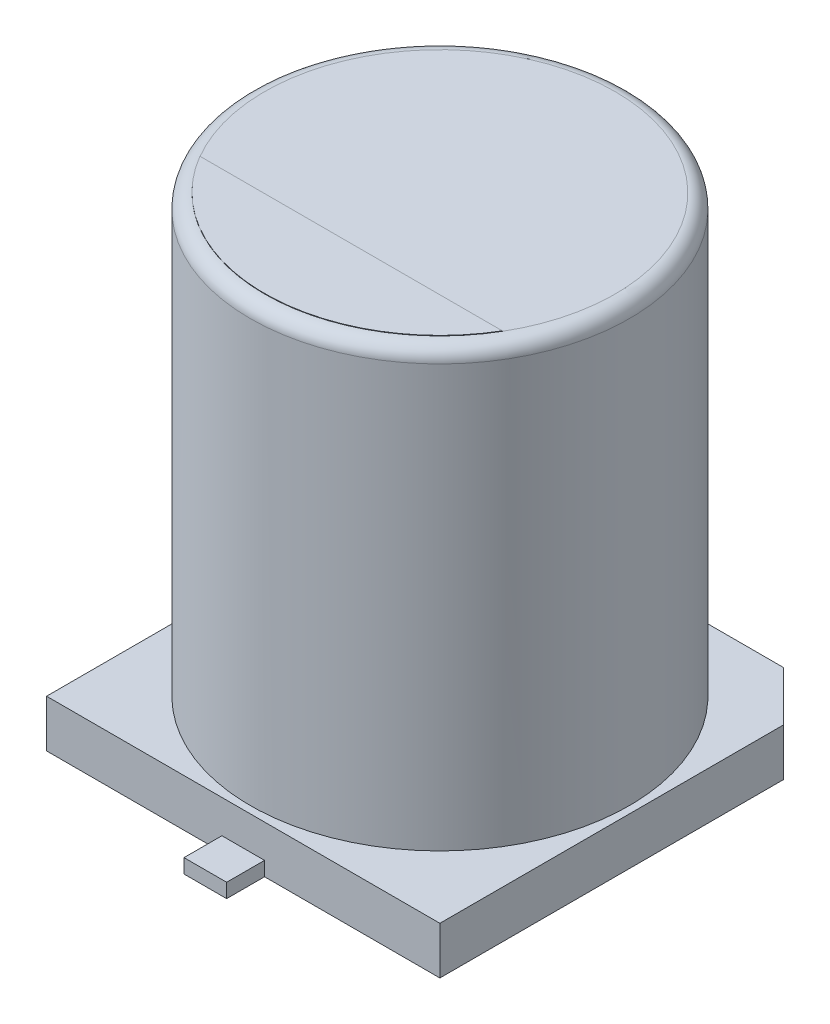
ISO-10303-21;
HEADER;
FILE_DESCRIPTION(('STEP AP214'),'2;1');
FILE_NAME('part.step','',(''),(''),'','','');
FILE_SCHEMA(('AUTOMOTIVE_DESIGN { 1 0 10303 214 1 1 1 1 }'));
ENDSEC;
DATA;
#1=APPLICATION_CONTEXT('core data for automotive mechanical design processes');
#2=APPLICATION_PROTOCOL_DEFINITION('international standard','automotive_design',2000,#1);
#3=PRODUCT_CONTEXT('',#1,'mechanical');
#4=PRODUCT('Part','Part','',(#3));
#5=PRODUCT_RELATED_PRODUCT_CATEGORY('part','',(#4));
#6=PRODUCT_DEFINITION_FORMATION('','',#4);
#7=PRODUCT_DEFINITION_CONTEXT('part definition',#1,'design');
#8=PRODUCT_DEFINITION('design','',#6,#7);
#9=PRODUCT_DEFINITION_SHAPE('','',#8);
#10=(LENGTH_UNIT() NAMED_UNIT(*) SI_UNIT(.MILLI.,.METRE.));
#11=(NAMED_UNIT(*) PLANE_ANGLE_UNIT() SI_UNIT($,.RADIAN.));
#12=(NAMED_UNIT(*) SI_UNIT($,.STERADIAN.) SOLID_ANGLE_UNIT());
#13=UNCERTAINTY_MEASURE_WITH_UNIT(LENGTH_MEASURE(1.E-05),#10,'distance_accuracy_value','');
#14=(GEOMETRIC_REPRESENTATION_CONTEXT(3) GLOBAL_UNCERTAINTY_ASSIGNED_CONTEXT((#13)) GLOBAL_UNIT_ASSIGNED_CONTEXT((#10,
#11,#12)) REPRESENTATION_CONTEXT('',''));
#15=CARTESIAN_POINT('',(0.,0.,0.));
#16=DIRECTION('',(0.,0.,1.));
#17=DIRECTION('',(1.,0.,0.));
#18=AXIS2_PLACEMENT_3D('',#15,#16,#17);
#19=CARTESIAN_POINT('',(0.,10.2,0.));
#20=DIRECTION('',(0.,1.,0.));
#21=DIRECTION('',(0.,0.,1.));
#22=AXIS2_PLACEMENT_3D('',#19,#20,#21);
#23=PLANE('',#22);
#24=CARTESIAN_POINT('',(0.,10.2,0.));
#25=DIRECTION('',(0.,1.,0.));
#26=DIRECTION('',(0.,0.,1.));
#27=AXIS2_PLACEMENT_3D('',#24,#25,#26);
#28=CIRCLE('',#27,3.7);
#29=CARTESIAN_POINT('',(3.1906821889042,10.2,1.87337854407739));
#30=VERTEX_POINT('',#29);
#31=CARTESIAN_POINT('',(-3.1906821889042,10.2,1.87337854407739));
#32=VERTEX_POINT('',#31);
#33=EDGE_CURVE('E221',#30,#32,#28,.T.);
#34=ORIENTED_EDGE('',*,*,#33,.T.);
#35=DIRECTION('',(-1.,0.,0.));
#36=VECTOR('',#35,1.);
#37=CARTESIAN_POINT('',(-3.1906821889042,10.2,1.87337854407739));
#38=LINE('',#37,#36);
#39=EDGE_CURVE('E159',#30,#32,#38,.T.);
#40=ORIENTED_EDGE('',*,*,#39,.F.);
#41=EDGE_LOOP('',(#34,#40));
#42=FACE_BOUND('',#41,.T.);
#43=ADVANCED_FACE('F33',(#42),#23,.T.);
#44=CARTESIAN_POINT('',(-3.1,1.,-4.15));
#45=DIRECTION('',(0.,0.,1.));
#46=DIRECTION('',(1.,0.,0.));
#47=AXIS2_PLACEMENT_3D('',#44,#45,#46);
#48=PLANE('',#47);
#49=DIRECTION('',(0.,-1.,0.));
#50=VECTOR('',#49,1.);
#51=CARTESIAN_POINT('',(0.449999999999999,1.,-4.15));
#52=LINE('',#51,#50);
#53=CARTESIAN_POINT('',(0.449999999999999,0.3,-4.15));
#54=VERTEX_POINT('',#53);
#55=CARTESIAN_POINT('',(0.449999999999998,0.,-4.15));
#56=VERTEX_POINT('',#55);
#57=EDGE_CURVE('E188',#54,#56,#52,.T.);
#58=ORIENTED_EDGE('',*,*,#57,.F.);
#59=DIRECTION('',(-1.,0.,0.));
#60=VECTOR('',#59,1.);
#61=CARTESIAN_POINT('',(-3.1,0.3,-4.15));
#62=LINE('',#61,#60);
#63=CARTESIAN_POINT('',(-0.450000000000001,0.3,-4.15));
#64=VERTEX_POINT('',#63);
#65=EDGE_CURVE('E11',#54,#64,#62,.T.);
#66=ORIENTED_EDGE('',*,*,#65,.T.);
#67=DIRECTION('',(0.,1.,0.));
#68=VECTOR('',#67,1.);
#69=CARTESIAN_POINT('',(-0.450000000000001,1.,-4.15));
#70=LINE('',#69,#68);
#71=CARTESIAN_POINT('',(-0.450000000000001,0.,-4.15));
#72=VERTEX_POINT('',#71);
#73=EDGE_CURVE('E186',#72,#64,#70,.T.);
#74=ORIENTED_EDGE('',*,*,#73,.F.);
#75=DIRECTION('',(-1.,0.,0.));
#76=VECTOR('',#75,1.);
#77=CARTESIAN_POINT('',(-3.1,0.,-4.15));
#78=LINE('',#77,#76);
#79=CARTESIAN_POINT('',(-3.1,0.,-4.15));
#80=VERTEX_POINT('',#79);
#81=EDGE_CURVE('E242',#72,#80,#78,.T.);
#82=ORIENTED_EDGE('',*,*,#81,.T.);
#83=DIRECTION('',(0.,-1.,0.));
#84=VECTOR('',#83,1.);
#85=CARTESIAN_POINT('',(-3.1,1.,-4.15));
#86=LINE('',#85,#84);
#87=CARTESIAN_POINT('',(-3.1,1.,-4.15));
#88=VERTEX_POINT('',#87);
#89=EDGE_CURVE('E259',#88,#80,#86,.T.);
#90=ORIENTED_EDGE('',*,*,#89,.F.);
#91=DIRECTION('',(-1.,0.,0.));
#92=VECTOR('',#91,1.);
#93=CARTESIAN_POINT('',(-3.1,1.,-4.15));
#94=LINE('',#93,#92);
#95=CARTESIAN_POINT('',(3.1,1.,-4.15));
#96=VERTEX_POINT('',#95);
#97=EDGE_CURVE('E229',#96,#88,#94,.T.);
#98=ORIENTED_EDGE('',*,*,#97,.F.);
#99=DIRECTION('',(0.,-1.,0.));
#100=VECTOR('',#99,1.);
#101=CARTESIAN_POINT('',(3.1,1.,-4.15));
#102=LINE('',#101,#100);
#103=CARTESIAN_POINT('',(3.1,0.,-4.15));
#104=VERTEX_POINT('',#103);
#105=EDGE_CURVE('E262',#96,#104,#102,.T.);
#106=ORIENTED_EDGE('',*,*,#105,.T.);
#107=EDGE_CURVE('E243',#104,#56,#78,.T.);
#108=ORIENTED_EDGE('',*,*,#107,.T.);
#109=EDGE_LOOP('',(#58,#66,#74,#82,#90,#98,#106,#108));
#110=FACE_BOUND('',#109,.T.);
#111=ADVANCED_FACE('F319',(#110),#48,.F.);
#112=CARTESIAN_POINT('',(4.15,1.,4.15));
#113=DIRECTION('',(0.,0.,-1.));
#114=DIRECTION('',(-1.,0.,0.));
#115=AXIS2_PLACEMENT_3D('',#112,#113,#114);
#116=PLANE('',#115);
#117=DIRECTION('',(0.,-1.,0.));
#118=VECTOR('',#117,1.);
#119=CARTESIAN_POINT('',(-0.450000000000001,1.,4.15));
#120=LINE('',#119,#118);
#121=CARTESIAN_POINT('',(-0.450000000000002,0.3,4.15));
#122=VERTEX_POINT('',#121);
#123=CARTESIAN_POINT('',(-0.449999999999999,0.,4.15));
#124=VERTEX_POINT('',#123);
#125=EDGE_CURVE('E214',#122,#124,#120,.T.);
#126=ORIENTED_EDGE('',*,*,#125,.F.);
#127=DIRECTION('',(-1.,0.,0.));
#128=VECTOR('',#127,1.);
#129=CARTESIAN_POINT('',(4.15,0.3,4.15));
#130=LINE('',#129,#128);
#131=CARTESIAN_POINT('',(0.449999999999999,0.3,4.15));
#132=VERTEX_POINT('',#131);
#133=EDGE_CURVE('E41',#132,#122,#130,.T.);
#134=ORIENTED_EDGE('',*,*,#133,.F.);
#135=DIRECTION('',(0.,1.,0.));
#136=VECTOR('',#135,1.);
#137=CARTESIAN_POINT('',(0.449999999999999,1.,4.15));
#138=LINE('',#137,#136);
#139=CARTESIAN_POINT('',(0.449999999999999,0.,4.15));
#140=VERTEX_POINT('',#139);
#141=EDGE_CURVE('E211',#140,#132,#138,.T.);
#142=ORIENTED_EDGE('',*,*,#141,.F.);
#143=DIRECTION('',(1.,0.,0.));
#144=VECTOR('',#143,1.);
#145=CARTESIAN_POINT('',(4.15,0.,4.15));
#146=LINE('',#145,#144);
#147=CARTESIAN_POINT('',(4.15,0.,4.15));
#148=VERTEX_POINT('',#147);
#149=EDGE_CURVE('E249',#140,#148,#146,.T.);
#150=ORIENTED_EDGE('',*,*,#149,.T.);
#151=DIRECTION('',(0.,-1.,0.));
#152=VECTOR('',#151,1.);
#153=CARTESIAN_POINT('',(4.15,1.,4.15));
#154=LINE('',#153,#152);
#155=CARTESIAN_POINT('',(4.15,1.,4.15));
#156=VERTEX_POINT('',#155);
#157=EDGE_CURVE('E237',#156,#148,#154,.T.);
#158=ORIENTED_EDGE('',*,*,#157,.F.);
#159=DIRECTION('',(1.,0.,0.));
#160=VECTOR('',#159,1.);
#161=CARTESIAN_POINT('',(4.15,1.,4.15));
#162=LINE('',#161,#160);
#163=CARTESIAN_POINT('',(-4.15,1.,4.15));
#164=VERTEX_POINT('',#163);
#165=EDGE_CURVE('E235',#164,#156,#162,.T.);
#166=ORIENTED_EDGE('',*,*,#165,.F.);
#167=DIRECTION('',(0.,-1.,0.));
#168=VECTOR('',#167,1.);
#169=CARTESIAN_POINT('',(-4.15,1.,4.15));
#170=LINE('',#169,#168);
#171=CARTESIAN_POINT('',(-4.15,0.,4.15));
#172=VERTEX_POINT('',#171);
#173=EDGE_CURVE('E253',#164,#172,#170,.T.);
#174=ORIENTED_EDGE('',*,*,#173,.T.);
#175=EDGE_CURVE('E227',#172,#124,#146,.T.);
#176=ORIENTED_EDGE('',*,*,#175,.T.);
#177=EDGE_LOOP('',(#126,#134,#142,#150,#158,#166,#174,#176));
#178=FACE_BOUND('',#177,.T.);
#179=ADVANCED_FACE('F289',(#178),#116,.F.);
#180=CARTESIAN_POINT('',(4.15,1.,-3.1));
#181=DIRECTION('',(-1.,0.,0.));
#182=DIRECTION('',(0.,0.,1.));
#183=AXIS2_PLACEMENT_3D('',#180,#181,#182);
#184=PLANE('',#183);
#185=DIRECTION('',(0.,0.,-1.));
#186=VECTOR('',#185,1.);
#187=CARTESIAN_POINT('',(4.15,0.,-3.1));
#188=LINE('',#187,#186);
#189=CARTESIAN_POINT('',(4.15,0.,-3.1));
#190=VERTEX_POINT('',#189);
#191=EDGE_CURVE('E217',#148,#190,#188,.T.);
#192=ORIENTED_EDGE('',*,*,#191,.T.);
#193=DIRECTION('',(0.,-1.,0.));
#194=VECTOR('',#193,1.);
#195=CARTESIAN_POINT('',(4.15,1.,-3.1));
#196=LINE('',#195,#194);
#197=CARTESIAN_POINT('',(4.15,1.,-3.1));
#198=VERTEX_POINT('',#197);
#199=EDGE_CURVE('E222',#198,#190,#196,.T.);
#200=ORIENTED_EDGE('',*,*,#199,.F.);
#201=DIRECTION('',(0.,0.,-1.));
#202=VECTOR('',#201,1.);
#203=CARTESIAN_POINT('',(4.15,1.,-3.1));
#204=LINE('',#203,#202);
#205=EDGE_CURVE('E223',#156,#198,#204,.T.);
#206=ORIENTED_EDGE('',*,*,#205,.F.);
#207=ORIENTED_EDGE('',*,*,#157,.T.);
#208=EDGE_LOOP('',(#192,#200,#206,#207));
#209=FACE_BOUND('',#208,.T.);
#210=ADVANCED_FACE('F296',(#209),#184,.F.);
#211=CARTESIAN_POINT('',(3.1,1.,-4.15));
#212=DIRECTION('',(-0.707106781186548,0.,0.707106781186547));
#213=DIRECTION('',(0.707106781186547,0.,0.707106781186548));
#214=AXIS2_PLACEMENT_3D('',#211,#212,#213);
#215=PLANE('',#214);
#216=DIRECTION('',(-0.707106781186547,0.,-0.707106781186548));
#217=VECTOR('',#216,1.);
#218=CARTESIAN_POINT('',(3.1,0.,-4.15));
#219=LINE('',#218,#217);
#220=EDGE_CURVE('E240',#190,#104,#219,.T.);
#221=ORIENTED_EDGE('',*,*,#220,.T.);
#222=ORIENTED_EDGE('',*,*,#105,.F.);
#223=DIRECTION('',(-0.707106781186547,0.,-0.707106781186548));
#224=VECTOR('',#223,1.);
#225=CARTESIAN_POINT('',(3.1,1.,-4.15));
#226=LINE('',#225,#224);
#227=EDGE_CURVE('E226',#198,#96,#226,.T.);
#228=ORIENTED_EDGE('',*,*,#227,.F.);
#229=ORIENTED_EDGE('',*,*,#199,.T.);
#230=EDGE_LOOP('',(#221,#222,#228,#229));
#231=FACE_BOUND('',#230,.T.);
#232=ADVANCED_FACE('F303',(#231),#215,.F.);
#233=CARTESIAN_POINT('',(-4.15,1.,-3.1));
#234=DIRECTION('',(0.707106781186548,0.,0.707106781186547));
#235=DIRECTION('',(0.707106781186547,0.,-0.707106781186548));
#236=AXIS2_PLACEMENT_3D('',#233,#234,#235);
#237=PLANE('',#236);
#238=DIRECTION('',(-0.707106781186547,0.,0.707106781186548));
#239=VECTOR('',#238,1.);
#240=CARTESIAN_POINT('',(-4.15,0.,-3.1));
#241=LINE('',#240,#239);
#242=CARTESIAN_POINT('',(-4.15,0.,-3.1));
#243=VERTEX_POINT('',#242);
#244=EDGE_CURVE('E245',#80,#243,#241,.T.);
#245=ORIENTED_EDGE('',*,*,#244,.T.);
#246=DIRECTION('',(0.,-1.,0.));
#247=VECTOR('',#246,1.);
#248=CARTESIAN_POINT('',(-4.15,1.,-3.1));
#249=LINE('',#248,#247);
#250=CARTESIAN_POINT('',(-4.15,1.,-3.1));
#251=VERTEX_POINT('',#250);
#252=EDGE_CURVE('E256',#251,#243,#249,.T.);
#253=ORIENTED_EDGE('',*,*,#252,.F.);
#254=DIRECTION('',(-0.707106781186547,0.,0.707106781186548));
#255=VECTOR('',#254,1.);
#256=CARTESIAN_POINT('',(-4.15,1.,-3.1));
#257=LINE('',#256,#255);
#258=EDGE_CURVE('E231',#88,#251,#257,.T.);
#259=ORIENTED_EDGE('',*,*,#258,.F.);
#260=ORIENTED_EDGE('',*,*,#89,.T.);
#261=EDGE_LOOP('',(#245,#253,#259,#260));
#262=FACE_BOUND('',#261,.T.);
#263=ADVANCED_FACE('F317',(#262),#237,.F.);
#264=CARTESIAN_POINT('',(-4.15,1.,4.15));
#265=DIRECTION('',(1.,0.,0.));
#266=DIRECTION('',(0.,0.,-1.));
#267=AXIS2_PLACEMENT_3D('',#264,#265,#266);
#268=PLANE('',#267);
#269=DIRECTION('',(0.,0.,1.));
#270=VECTOR('',#269,1.);
#271=CARTESIAN_POINT('',(-4.15,0.,4.15));
#272=LINE('',#271,#270);
#273=EDGE_CURVE('E247',#243,#172,#272,.T.);
#274=ORIENTED_EDGE('',*,*,#273,.T.);
#275=ORIENTED_EDGE('',*,*,#173,.F.);
#276=DIRECTION('',(0.,0.,1.));
#277=VECTOR('',#276,1.);
#278=CARTESIAN_POINT('',(-4.15,1.,4.15));
#279=LINE('',#278,#277);
#280=EDGE_CURVE('E233',#251,#164,#279,.T.);
#281=ORIENTED_EDGE('',*,*,#280,.F.);
#282=ORIENTED_EDGE('',*,*,#252,.T.);
#283=EDGE_LOOP('',(#274,#275,#281,#282));
#284=FACE_BOUND('',#283,.T.);
#285=ADVANCED_FACE('F313',(#284),#268,.F.);
#286=CARTESIAN_POINT('',(0.,1.,0.));
#287=DIRECTION('',(0.,-1.,0.));
#288=DIRECTION('',(0.,0.,-1.));
#289=AXIS2_PLACEMENT_3D('',#286,#287,#288);
#290=PLANE('',#289);
#291=CARTESIAN_POINT('',(0.,0.999999999999999,0.));
#292=DIRECTION('',(0.,-1.,0.));
#293=DIRECTION('',(0.,0.,-1.));
#294=AXIS2_PLACEMENT_3D('',#291,#292,#293);
#295=CIRCLE('',#294,4.);
#296=CARTESIAN_POINT('',(0.,0.999999999999999,-4.));
#297=VERTEX_POINT('',#296);
#298=EDGE_CURVE('E218',#297,#297,#295,.F.);
#299=ORIENTED_EDGE('',*,*,#298,.F.);
#300=EDGE_LOOP('',(#299));
#301=FACE_BOUND('',#300,.T.);
#302=ORIENTED_EDGE('',*,*,#205,.T.);
#303=ORIENTED_EDGE('',*,*,#227,.T.);
#304=ORIENTED_EDGE('',*,*,#97,.T.);
#305=ORIENTED_EDGE('',*,*,#258,.T.);
#306=ORIENTED_EDGE('',*,*,#280,.T.);
#307=ORIENTED_EDGE('',*,*,#165,.T.);
#308=EDGE_LOOP('',(#302,#303,#304,#305,#306,#307));
#309=FACE_BOUND('',#308,.T.);
#310=ADVANCED_FACE('F306',(#301,#309),#290,.F.);
#311=CARTESIAN_POINT('',(0.,0.,0.));
#312=DIRECTION('',(0.,-1.,0.));
#313=DIRECTION('',(0.,0.,-1.));
#314=AXIS2_PLACEMENT_3D('',#311,#312,#313);
#315=PLANE('',#314);
#316=ORIENTED_EDGE('',*,*,#81,.F.);
#317=DIRECTION('',(0.,0.,1.));
#318=VECTOR('',#317,1.);
#319=CARTESIAN_POINT('',(-0.45,0.,-1.55));
#320=LINE('',#319,#318);
#321=CARTESIAN_POINT('',(-0.450000000000001,0.,-4.95));
#322=VERTEX_POINT('',#321);
#323=EDGE_CURVE('E172',#322,#72,#320,.T.);
#324=ORIENTED_EDGE('',*,*,#323,.F.);
#325=DIRECTION('',(-1.,0.,0.));
#326=VECTOR('',#325,1.);
#327=CARTESIAN_POINT('',(0.449999999999999,0.,-4.95));
#328=LINE('',#327,#326);
#329=CARTESIAN_POINT('',(0.449999999999999,0.,-4.95));
#330=VERTEX_POINT('',#329);
#331=EDGE_CURVE('E164',#330,#322,#328,.T.);
#332=ORIENTED_EDGE('',*,*,#331,.F.);
#333=DIRECTION('',(0.,0.,-1.));
#334=VECTOR('',#333,1.);
#335=CARTESIAN_POINT('',(0.449999999999999,0.,-1.55));
#336=LINE('',#335,#334);
#337=EDGE_CURVE('E162',#56,#330,#336,.T.);
#338=ORIENTED_EDGE('',*,*,#337,.F.);
#339=ORIENTED_EDGE('',*,*,#107,.F.);
#340=ORIENTED_EDGE('',*,*,#220,.F.);
#341=ORIENTED_EDGE('',*,*,#191,.F.);
#342=ORIENTED_EDGE('',*,*,#149,.F.);
#343=DIRECTION('',(0.,0.,-1.));
#344=VECTOR('',#343,1.);
#345=CARTESIAN_POINT('',(0.449999999999999,0.,1.55));
#346=LINE('',#345,#344);
#347=CARTESIAN_POINT('',(0.449999999999999,0.,4.95));
#348=VERTEX_POINT('',#347);
#349=EDGE_CURVE('E195',#348,#140,#346,.T.);
#350=ORIENTED_EDGE('',*,*,#349,.F.);
#351=DIRECTION('',(1.,0.,0.));
#352=VECTOR('',#351,1.);
#353=CARTESIAN_POINT('',(0.449999999999999,0.,4.95));
#354=LINE('',#353,#352);
#355=CARTESIAN_POINT('',(-0.450000000000001,0.,4.95));
#356=VERTEX_POINT('',#355);
#357=EDGE_CURVE('E202',#356,#348,#354,.T.);
#358=ORIENTED_EDGE('',*,*,#357,.F.);
#359=DIRECTION('',(0.,0.,1.));
#360=VECTOR('',#359,1.);
#361=CARTESIAN_POINT('',(-0.45,0.,1.55));
#362=LINE('',#361,#360);
#363=EDGE_CURVE('E191',#124,#356,#362,.T.);
#364=ORIENTED_EDGE('',*,*,#363,.F.);
#365=ORIENTED_EDGE('',*,*,#175,.F.);
#366=ORIENTED_EDGE('',*,*,#273,.F.);
#367=ORIENTED_EDGE('',*,*,#244,.F.);
#368=EDGE_LOOP('',(#316,#324,#332,#338,#339,#340,#341,#342,#350,#358,#364,#365,#366,#367));
#369=FACE_BOUND('',#368,.T.);
#370=ADVANCED_FACE('F298',(#369),#315,.T.);
#371=CARTESIAN_POINT('',(0.,10.2,0.));
#372=DIRECTION('',(0.,-1.,0.));
#373=DIRECTION('',(0.,0.,-1.));
#374=AXIS2_PLACEMENT_3D('',#371,#372,#373);
#375=CYLINDRICAL_SURFACE('',#374,4.);
#376=CARTESIAN_POINT('',(0.,9.9,0.));
#377=DIRECTION('',(0.,1.,0.));
#378=DIRECTION('',(0.,0.,1.));
#379=AXIS2_PLACEMENT_3D('',#376,#377,#378);
#380=CIRCLE('',#379,4.);
#381=CARTESIAN_POINT('',(0.,9.9,4.));
#382=VERTEX_POINT('',#381);
#383=EDGE_CURVE('E268',#382,#382,#380,.F.);
#384=ORIENTED_EDGE('',*,*,#383,.T.);
#385=EDGE_LOOP('',(#384));
#386=FACE_BOUND('',#385,.T.);
#387=ORIENTED_EDGE('',*,*,#298,.T.);
#388=EDGE_LOOP('',(#387));
#389=FACE_BOUND('',#388,.T.);
#390=ADVANCED_FACE('F354',(#386,#389),#375,.T.);
#391=CARTESIAN_POINT('',(0.,9.9,0.));
#392=DIRECTION('',(0.,1.,0.));
#393=DIRECTION('',(0.,0.,1.));
#394=AXIS2_PLACEMENT_3D('',#391,#392,#393);
#395=TOROIDAL_SURFACE('',#394,3.7,0.3);
#396=ORIENTED_EDGE('',*,*,#383,.F.);
#397=EDGE_LOOP('',(#396));
#398=FACE_BOUND('',#397,.T.);
#399=ORIENTED_EDGE('',*,*,#33,.F.);
#400=CARTESIAN_POINT('',(0.,10.2,0.));
#401=DIRECTION('',(0.,1.,0.));
#402=DIRECTION('',(0.,0.,1.));
#403=AXIS2_PLACEMENT_3D('',#400,#401,#402);
#404=CIRCLE('',#403,3.7);
#405=EDGE_CURVE('E47',#32,#30,#404,.T.);
#406=ORIENTED_EDGE('',*,*,#405,.F.);
#407=EDGE_LOOP('',(#399,#406));
#408=FACE_BOUND('',#407,.T.);
#409=ADVANCED_FACE('F35',(#398,#408),#395,.T.);
#410=CARTESIAN_POINT('',(0.,0.3,0.));
#411=DIRECTION('',(0.,-1.,0.));
#412=DIRECTION('',(0.,0.,-1.));
#413=AXIS2_PLACEMENT_3D('',#410,#411,#412);
#414=PLANE('',#413);
#415=DIRECTION('',(0.,0.,-1.));
#416=VECTOR('',#415,1.);
#417=CARTESIAN_POINT('',(0.449999999999999,0.3,1.55));
#418=LINE('',#417,#416);
#419=CARTESIAN_POINT('',(0.449999999999999,0.3,4.95));
#420=VERTEX_POINT('',#419);
#421=EDGE_CURVE('E197',#420,#132,#418,.T.);
#422=ORIENTED_EDGE('',*,*,#421,.T.);
#423=ORIENTED_EDGE('',*,*,#133,.T.);
#424=DIRECTION('',(0.,0.,1.));
#425=VECTOR('',#424,1.);
#426=CARTESIAN_POINT('',(-0.45,0.3,1.55));
#427=LINE('',#426,#425);
#428=CARTESIAN_POINT('',(-0.450000000000001,0.3,4.95));
#429=VERTEX_POINT('',#428);
#430=EDGE_CURVE('E192',#122,#429,#427,.T.);
#431=ORIENTED_EDGE('',*,*,#430,.T.);
#432=DIRECTION('',(1.,0.,0.));
#433=VECTOR('',#432,1.);
#434=CARTESIAN_POINT('',(0.449999999999999,0.3,4.95));
#435=LINE('',#434,#433);
#436=EDGE_CURVE('E194',#429,#420,#435,.T.);
#437=ORIENTED_EDGE('',*,*,#436,.T.);
#438=EDGE_LOOP('',(#422,#423,#431,#437));
#439=FACE_BOUND('',#438,.T.);
#440=ADVANCED_FACE('F273',(#439),#414,.F.);
#441=CARTESIAN_POINT('',(-0.45,0.3,1.55));
#442=DIRECTION('',(1.,0.,0.));
#443=DIRECTION('',(0.,0.,-1.));
#444=AXIS2_PLACEMENT_3D('',#441,#442,#443);
#445=PLANE('',#444);
#446=ORIENTED_EDGE('',*,*,#430,.F.);
#447=ORIENTED_EDGE('',*,*,#125,.T.);
#448=ORIENTED_EDGE('',*,*,#363,.T.);
#449=DIRECTION('',(0.,-1.,0.));
#450=VECTOR('',#449,1.);
#451=CARTESIAN_POINT('',(-0.450000000000001,0.3,4.95));
#452=LINE('',#451,#450);
#453=EDGE_CURVE('E208',#429,#356,#452,.T.);
#454=ORIENTED_EDGE('',*,*,#453,.F.);
#455=EDGE_LOOP('',(#446,#447,#448,#454));
#456=FACE_BOUND('',#455,.T.);
#457=ADVANCED_FACE('F280',(#456),#445,.F.);
#458=CARTESIAN_POINT('',(0.449999999999999,0.3,1.55));
#459=DIRECTION('',(-1.,0.,0.));
#460=DIRECTION('',(0.,0.,1.));
#461=AXIS2_PLACEMENT_3D('',#458,#459,#460);
#462=PLANE('',#461);
#463=ORIENTED_EDGE('',*,*,#349,.T.);
#464=ORIENTED_EDGE('',*,*,#141,.T.);
#465=ORIENTED_EDGE('',*,*,#421,.F.);
#466=DIRECTION('',(0.,-1.,0.));
#467=VECTOR('',#466,1.);
#468=CARTESIAN_POINT('',(0.449999999999999,0.3,4.95));
#469=LINE('',#468,#467);
#470=EDGE_CURVE('E200',#420,#348,#469,.T.);
#471=ORIENTED_EDGE('',*,*,#470,.T.);
#472=EDGE_LOOP('',(#463,#464,#465,#471));
#473=FACE_BOUND('',#472,.T.);
#474=ADVANCED_FACE('F288',(#473),#462,.F.);
#475=CARTESIAN_POINT('',(0.449999999999999,0.3,4.95));
#476=DIRECTION('',(0.,0.,-1.));
#477=DIRECTION('',(-1.,0.,0.));
#478=AXIS2_PLACEMENT_3D('',#475,#476,#477);
#479=PLANE('',#478);
#480=ORIENTED_EDGE('',*,*,#357,.T.);
#481=ORIENTED_EDGE('',*,*,#470,.F.);
#482=ORIENTED_EDGE('',*,*,#436,.F.);
#483=ORIENTED_EDGE('',*,*,#453,.T.);
#484=EDGE_LOOP('',(#480,#481,#482,#483));
#485=FACE_BOUND('',#484,.T.);
#486=ADVANCED_FACE('F284',(#485),#479,.F.);
#487=CARTESIAN_POINT('',(0.,0.3,0.));
#488=DIRECTION('',(0.,1.,0.));
#489=DIRECTION('',(0.,0.,1.));
#490=AXIS2_PLACEMENT_3D('',#487,#488,#489);
#491=PLANE('',#490);
#492=ORIENTED_EDGE('',*,*,#65,.F.);
#493=DIRECTION('',(0.,0.,-1.));
#494=VECTOR('',#493,1.);
#495=CARTESIAN_POINT('',(0.449999999999999,0.3,-1.55));
#496=LINE('',#495,#494);
#497=CARTESIAN_POINT('',(0.449999999999999,0.3,-4.95));
#498=VERTEX_POINT('',#497);
#499=EDGE_CURVE('E169',#54,#498,#496,.T.);
#500=ORIENTED_EDGE('',*,*,#499,.T.);
#501=DIRECTION('',(-1.,0.,0.));
#502=VECTOR('',#501,1.);
#503=CARTESIAN_POINT('',(0.449999999999999,0.3,-4.95));
#504=LINE('',#503,#502);
#505=CARTESIAN_POINT('',(-0.450000000000001,0.3,-4.95));
#506=VERTEX_POINT('',#505);
#507=EDGE_CURVE('E171',#498,#506,#504,.T.);
#508=ORIENTED_EDGE('',*,*,#507,.T.);
#509=DIRECTION('',(0.,0.,1.));
#510=VECTOR('',#509,1.);
#511=CARTESIAN_POINT('',(-0.45,0.3,-1.55));
#512=LINE('',#511,#510);
#513=EDGE_CURVE('E174',#506,#64,#512,.T.);
#514=ORIENTED_EDGE('',*,*,#513,.T.);
#515=EDGE_LOOP('',(#492,#500,#508,#514));
#516=FACE_BOUND('',#515,.T.);
#517=ADVANCED_FACE('F334',(#516),#491,.T.);
#518=CARTESIAN_POINT('',(0.449999999999999,0.3,-1.55));
#519=DIRECTION('',(-1.,0.,0.));
#520=DIRECTION('',(0.,0.,1.));
#521=AXIS2_PLACEMENT_3D('',#518,#519,#520);
#522=PLANE('',#521);
#523=ORIENTED_EDGE('',*,*,#499,.F.);
#524=ORIENTED_EDGE('',*,*,#57,.T.);
#525=ORIENTED_EDGE('',*,*,#337,.T.);
#526=DIRECTION('',(0.,-1.,0.));
#527=VECTOR('',#526,1.);
#528=CARTESIAN_POINT('',(0.449999999999999,0.3,-4.95));
#529=LINE('',#528,#527);
#530=EDGE_CURVE('E183',#498,#330,#529,.T.);
#531=ORIENTED_EDGE('',*,*,#530,.F.);
#532=EDGE_LOOP('',(#523,#524,#525,#531));
#533=FACE_BOUND('',#532,.T.);
#534=ADVANCED_FACE('F332',(#533),#522,.F.);
#535=CARTESIAN_POINT('',(-0.45,0.3,-1.55));
#536=DIRECTION('',(1.,0.,0.));
#537=DIRECTION('',(0.,0.,-1.));
#538=AXIS2_PLACEMENT_3D('',#535,#536,#537);
#539=PLANE('',#538);
#540=ORIENTED_EDGE('',*,*,#323,.T.);
#541=ORIENTED_EDGE('',*,*,#73,.T.);
#542=ORIENTED_EDGE('',*,*,#513,.F.);
#543=DIRECTION('',(0.,-1.,0.));
#544=VECTOR('',#543,1.);
#545=CARTESIAN_POINT('',(-0.450000000000001,0.3,-4.95));
#546=LINE('',#545,#544);
#547=EDGE_CURVE('E176',#506,#322,#546,.T.);
#548=ORIENTED_EDGE('',*,*,#547,.T.);
#549=EDGE_LOOP('',(#540,#541,#542,#548));
#550=FACE_BOUND('',#549,.T.);
#551=ADVANCED_FACE('F323',(#550),#539,.F.);
#552=CARTESIAN_POINT('',(0.449999999999999,0.3,-4.95));
#553=DIRECTION('',(0.,0.,1.));
#554=DIRECTION('',(1.,0.,0.));
#555=AXIS2_PLACEMENT_3D('',#552,#553,#554);
#556=PLANE('',#555);
#557=ORIENTED_EDGE('',*,*,#331,.T.);
#558=ORIENTED_EDGE('',*,*,#547,.F.);
#559=ORIENTED_EDGE('',*,*,#507,.F.);
#560=ORIENTED_EDGE('',*,*,#530,.T.);
#561=EDGE_LOOP('',(#557,#558,#559,#560));
#562=FACE_BOUND('',#561,.T.);
#563=ADVANCED_FACE('F328',(#562),#556,.F.);
#564=CARTESIAN_POINT('',(0.,10.21,0.));
#565=DIRECTION('',(0.,-1.,0.));
#566=DIRECTION('',(0.,0.,-1.));
#567=AXIS2_PLACEMENT_3D('',#564,#565,#566);
#568=CYLINDRICAL_SURFACE('',#567,3.7);
#569=ORIENTED_EDGE('',*,*,#405,.T.);
#570=DIRECTION('',(0.,-1.,0.));
#571=VECTOR('',#570,1.);
#572=CARTESIAN_POINT('',(3.1906821889042,10.21,1.87337854407739));
#573=LINE('',#572,#571);
#574=CARTESIAN_POINT('',(3.1906821889042,10.21,1.87337854407739));
#575=VERTEX_POINT('',#574);
#576=EDGE_CURVE('E150',#575,#30,#573,.T.);
#577=ORIENTED_EDGE('',*,*,#576,.F.);
#578=CARTESIAN_POINT('',(0.,10.21,0.));
#579=DIRECTION('',(0.,1.,0.));
#580=DIRECTION('',(0.,0.,1.));
#581=AXIS2_PLACEMENT_3D('',#578,#579,#580);
#582=CIRCLE('',#581,3.7);
#583=CARTESIAN_POINT('',(-3.1906821889042,10.21,1.87337854407739));
#584=VERTEX_POINT('',#583);
#585=EDGE_CURVE('E155',#584,#575,#582,.T.);
#586=ORIENTED_EDGE('',*,*,#585,.F.);
#587=DIRECTION('',(0.,-1.,0.));
#588=VECTOR('',#587,1.);
#589=CARTESIAN_POINT('',(-3.1906821889042,10.21,1.87337854407739));
#590=LINE('',#589,#588);
#591=EDGE_CURVE('E152',#584,#32,#590,.T.);
#592=ORIENTED_EDGE('',*,*,#591,.T.);
#593=EDGE_LOOP('',(#569,#577,#586,#592));
#594=FACE_BOUND('',#593,.T.);
#595=ADVANCED_FACE('F161',(#594),#568,.T.);
#596=CARTESIAN_POINT('',(-3.1906821889042,10.21,1.87337854407739));
#597=DIRECTION('',(0.,0.,1.));
#598=DIRECTION('',(1.,0.,0.));
#599=AXIS2_PLACEMENT_3D('',#596,#597,#598);
#600=PLANE('',#599);
#601=ORIENTED_EDGE('',*,*,#39,.T.);
#602=ORIENTED_EDGE('',*,*,#591,.F.);
#603=DIRECTION('',(-1.,0.,0.));
#604=VECTOR('',#603,1.);
#605=CARTESIAN_POINT('',(-3.1906821889042,10.21,1.87337854407739));
#606=LINE('',#605,#604);
#607=EDGE_CURVE('E145',#575,#584,#606,.T.);
#608=ORIENTED_EDGE('',*,*,#607,.F.);
#609=ORIENTED_EDGE('',*,*,#576,.T.);
#610=EDGE_LOOP('',(#601,#602,#608,#609));
#611=FACE_BOUND('',#610,.T.);
#612=ADVANCED_FACE('F148',(#611),#600,.F.);
#613=CARTESIAN_POINT('',(0.,10.21,0.));
#614=DIRECTION('',(0.,1.,0.));
#615=DIRECTION('',(0.,0.,1.));
#616=AXIS2_PLACEMENT_3D('',#613,#614,#615);
#617=PLANE('',#616);
#618=ORIENTED_EDGE('',*,*,#585,.T.);
#619=ORIENTED_EDGE('',*,*,#607,.T.);
#620=EDGE_LOOP('',(#618,#619));
#621=FACE_BOUND('',#620,.T.);
#622=ADVANCED_FACE('F157',(#621),#617,.T.);
#623=CLOSED_SHELL('',(#43,#111,#179,#210,#232,#263,#285,#310,#370,#390,#409,#440,#457,#474,#486,
#517,#534,#551,#563,#595,#612,#622));
#624=MANIFOLD_SOLID_BREP('B2',#623);
#625=ADVANCED_BREP_SHAPE_REPRESENTATION('',(#18,#624),#14);
#626=SHAPE_DEFINITION_REPRESENTATION(#9,#625);
ENDSEC;
END-ISO-10303-21;
